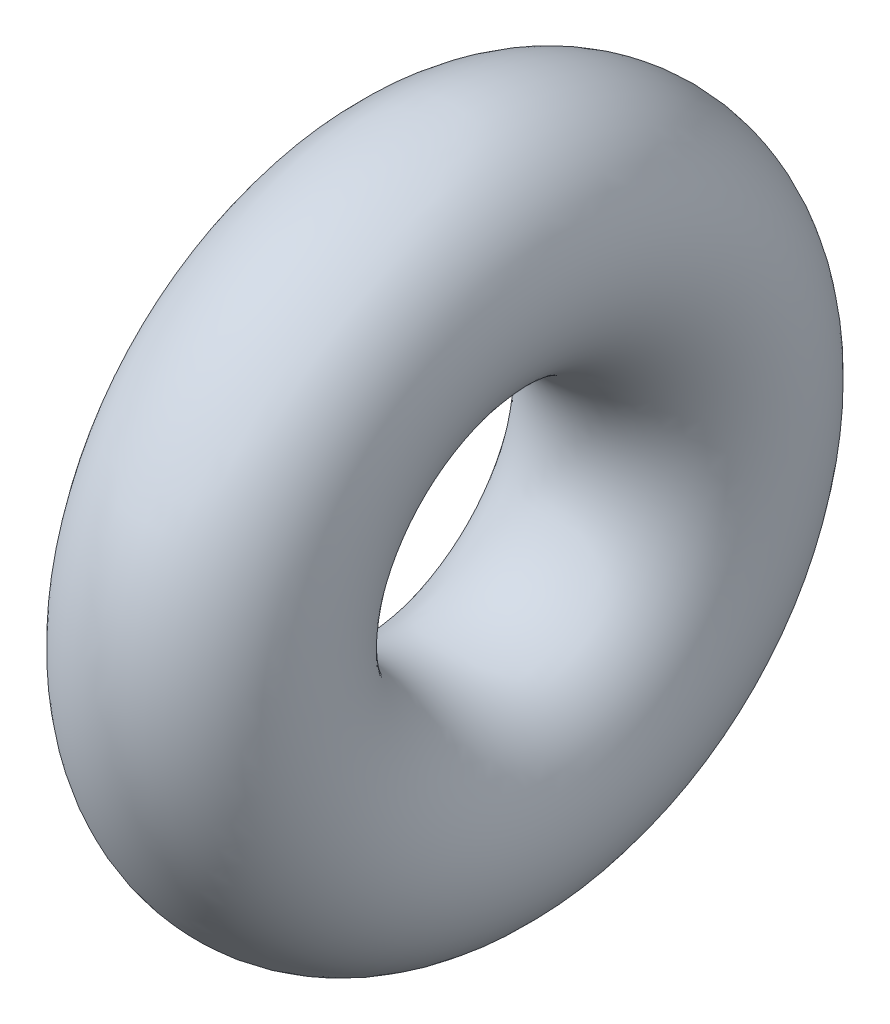
ISO-10303-21;
HEADER;
FILE_DESCRIPTION(('STEP AP214'),'2;1');
FILE_NAME('part.step','',(''),(''),'','','');
FILE_SCHEMA(('AUTOMOTIVE_DESIGN { 1 0 10303 214 1 1 1 1 }'));
ENDSEC;
DATA;
#1=APPLICATION_CONTEXT('core data for automotive mechanical design processes');
#2=APPLICATION_PROTOCOL_DEFINITION('international standard','automotive_design',2000,#1);
#3=PRODUCT_CONTEXT('',#1,'mechanical');
#4=PRODUCT('Part','Part','',(#3));
#5=PRODUCT_RELATED_PRODUCT_CATEGORY('part','',(#4));
#6=PRODUCT_DEFINITION_FORMATION('','',#4);
#7=PRODUCT_DEFINITION_CONTEXT('part definition',#1,'design');
#8=PRODUCT_DEFINITION('design','',#6,#7);
#9=PRODUCT_DEFINITION_SHAPE('','',#8);
#10=(LENGTH_UNIT() NAMED_UNIT(*) SI_UNIT(.MILLI.,.METRE.));
#11=(NAMED_UNIT(*) PLANE_ANGLE_UNIT() SI_UNIT($,.RADIAN.));
#12=(NAMED_UNIT(*) SI_UNIT($,.STERADIAN.) SOLID_ANGLE_UNIT());
#13=UNCERTAINTY_MEASURE_WITH_UNIT(LENGTH_MEASURE(1.E-05),#10,'distance_accuracy_value','');
#14=(GEOMETRIC_REPRESENTATION_CONTEXT(3) GLOBAL_UNCERTAINTY_ASSIGNED_CONTEXT((#13)) GLOBAL_UNIT_ASSIGNED_CONTEXT((#10,
#11,#12)) REPRESENTATION_CONTEXT('',''));
#15=CARTESIAN_POINT('',(0.,0.,0.));
#16=DIRECTION('',(0.,0.,1.));
#17=DIRECTION('',(1.,0.,0.));
#18=AXIS2_PLACEMENT_3D('',#15,#16,#17);
#19=CARTESIAN_POINT('',(-3.6,-3.6,15.424059202831));
#20=DIRECTION('',(-1.,0.,0.));
#21=DIRECTION('',(0.,0.,-1.));
#22=AXIS2_PLACEMENT_3D('',#19,#20,#21);
#23=TOROIDAL_SURFACE('',#22,0.333333333333,0.166666666667);
#24=ADVANCED_FACE('F14',(),#23,.T.);
#25=CLOSED_SHELL('',(#24));
#26=MANIFOLD_SOLID_BREP('B1',#25);
#27=ADVANCED_BREP_SHAPE_REPRESENTATION('',(#18,#26),#14);
#28=SHAPE_DEFINITION_REPRESENTATION(#9,#27);
ENDSEC;
END-ISO-10303-21;
